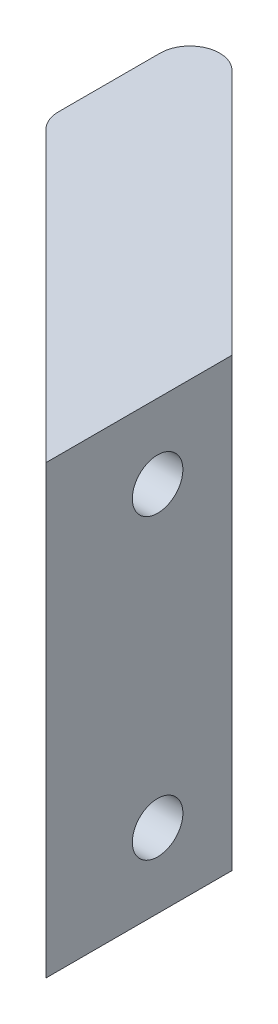
ISO-10303-21;
HEADER;
FILE_DESCRIPTION(('STEP AP214'),'2;1');
FILE_NAME('part.step','',(''),(''),'','','');
FILE_SCHEMA(('AUTOMOTIVE_DESIGN { 1 0 10303 214 1 1 1 1 }'));
ENDSEC;
DATA;
#1=APPLICATION_CONTEXT('core data for automotive mechanical design processes');
#2=APPLICATION_PROTOCOL_DEFINITION('international standard','automotive_design',2000,#1);
#3=PRODUCT_CONTEXT('',#1,'mechanical');
#4=PRODUCT('Part','Part','',(#3));
#5=PRODUCT_RELATED_PRODUCT_CATEGORY('part','',(#4));
#6=PRODUCT_DEFINITION_FORMATION('','',#4);
#7=PRODUCT_DEFINITION_CONTEXT('part definition',#1,'design');
#8=PRODUCT_DEFINITION('design','',#6,#7);
#9=PRODUCT_DEFINITION_SHAPE('','',#8);
#10=(LENGTH_UNIT() NAMED_UNIT(*) SI_UNIT(.MILLI.,.METRE.));
#11=(NAMED_UNIT(*) PLANE_ANGLE_UNIT() SI_UNIT($,.RADIAN.));
#12=(NAMED_UNIT(*) SI_UNIT($,.STERADIAN.) SOLID_ANGLE_UNIT());
#13=UNCERTAINTY_MEASURE_WITH_UNIT(LENGTH_MEASURE(1.E-05),#10,'distance_accuracy_value','');
#14=(GEOMETRIC_REPRESENTATION_CONTEXT(3) GLOBAL_UNCERTAINTY_ASSIGNED_CONTEXT((#13)) GLOBAL_UNIT_ASSIGNED_CONTEXT((#10,
#11,#12)) REPRESENTATION_CONTEXT('',''));
#15=CARTESIAN_POINT('',(0.,0.,0.));
#16=DIRECTION('',(0.,0.,1.));
#17=DIRECTION('',(1.,0.,0.));
#18=AXIS2_PLACEMENT_3D('',#15,#16,#17);
#19=CARTESIAN_POINT('',(-20.,15.,-25.0000000000002));
#20=DIRECTION('',(-0.707106781186551,0.,0.707106781186544));
#21=DIRECTION('',(0.707106781186544,0.,0.707106781186551));
#22=AXIS2_PLACEMENT_3D('',#19,#20,#21);
#23=PLANE('',#22);
#24=DIRECTION('',(-0.707106781186544,0.,-0.707106781186551));
#25=VECTOR('',#24,1.);
#26=CARTESIAN_POINT('',(-20.,-15.,-25.0000000000002));
#27=LINE('',#26,#25);
#28=CARTESIAN_POINT('',(0.,-15.,-5.));
#29=VERTEX_POINT('',#28);
#30=CARTESIAN_POINT('',(-16.5857864376269,-15.,-21.5857864376271));
#31=VERTEX_POINT('',#30);
#32=EDGE_CURVE('E126',#29,#31,#27,.T.);
#33=ORIENTED_EDGE('',*,*,#32,.T.);
#34=DIRECTION('',(0.,-1.,0.));
#35=VECTOR('',#34,1.);
#36=CARTESIAN_POINT('',(-16.5857864376269,15.,-21.5857864376271));
#37=LINE('',#36,#35);
#38=CARTESIAN_POINT('',(-16.5857864376269,15.,-21.5857864376271));
#39=VERTEX_POINT('',#38);
#40=EDGE_CURVE('E11',#31,#39,#37,.F.);
#41=ORIENTED_EDGE('',*,*,#40,.T.);
#42=DIRECTION('',(-0.707106781186544,0.,-0.707106781186551));
#43=VECTOR('',#42,1.);
#44=CARTESIAN_POINT('',(-20.,15.,-25.0000000000002));
#45=LINE('',#44,#43);
#46=CARTESIAN_POINT('',(0.,15.,-5.));
#47=VERTEX_POINT('',#46);
#48=EDGE_CURVE('E90',#47,#39,#45,.T.);
#49=ORIENTED_EDGE('',*,*,#48,.F.);
#50=DIRECTION('',(0.,-1.,0.));
#51=VECTOR('',#50,1.);
#52=CARTESIAN_POINT('',(0.,15.,-5.));
#53=LINE('',#52,#51);
#54=EDGE_CURVE('E93',#47,#29,#53,.T.);
#55=ORIENTED_EDGE('',*,*,#54,.T.);
#56=EDGE_LOOP('',(#33,#41,#49,#55));
#57=FACE_BOUND('',#56,.T.);
#58=ADVANCED_FACE('F38',(#57),#23,.F.);
#59=CARTESIAN_POINT('',(-20.,15.,-12.5000000000002));
#60=DIRECTION('',(1.,0.,0.));
#61=DIRECTION('',(0.,0.,-1.));
#62=AXIS2_PLACEMENT_3D('',#59,#60,#61);
#63=PLANE('',#62);
#64=DIRECTION('',(0.,0.,1.));
#65=VECTOR('',#64,1.);
#66=CARTESIAN_POINT('',(-20.,-15.,-12.5000000000002));
#67=LINE('',#66,#65);
#68=CARTESIAN_POINT('',(-20.,-15.,-20.171572875254));
#69=VERTEX_POINT('',#68);
#70=CARTESIAN_POINT('',(-20.,-15.,-13.3284271247464));
#71=VERTEX_POINT('',#70);
#72=EDGE_CURVE('E147',#69,#71,#67,.T.);
#73=ORIENTED_EDGE('',*,*,#72,.T.);
#74=DIRECTION('',(0.,-1.,0.));
#75=VECTOR('',#74,1.);
#76=CARTESIAN_POINT('',(-20.,15.,-13.3284271247464));
#77=LINE('',#76,#75);
#78=CARTESIAN_POINT('',(-20.,15.,-13.3284271247464));
#79=VERTEX_POINT('',#78);
#80=EDGE_CURVE('E59',#71,#79,#77,.F.);
#81=ORIENTED_EDGE('',*,*,#80,.T.);
#82=DIRECTION('',(0.,0.,1.));
#83=VECTOR('',#82,1.);
#84=CARTESIAN_POINT('',(-20.,15.,-12.5000000000002));
#85=LINE('',#84,#83);
#86=CARTESIAN_POINT('',(-20.,15.,-20.171572875254));
#87=VERTEX_POINT('',#86);
#88=EDGE_CURVE('E96',#87,#79,#85,.T.);
#89=ORIENTED_EDGE('',*,*,#88,.F.);
#90=DIRECTION('',(0.,-1.,0.));
#91=VECTOR('',#90,1.);
#92=CARTESIAN_POINT('',(-20.,15.,-20.171572875254));
#93=LINE('',#92,#91);
#94=EDGE_CURVE('E131',#87,#69,#93,.T.);
#95=ORIENTED_EDGE('',*,*,#94,.T.);
#96=EDGE_LOOP('',(#73,#81,#89,#95));
#97=FACE_BOUND('',#96,.T.);
#98=ADVANCED_FACE('F149',(#97),#63,.F.);
#99=CARTESIAN_POINT('',(0.,15.,7.5));
#100=DIRECTION('',(0.707106781186551,0.,-0.707106781186544));
#101=DIRECTION('',(-0.707106781186544,0.,-0.707106781186551));
#102=AXIS2_PLACEMENT_3D('',#99,#100,#101);
#103=PLANE('',#102);
#104=CARTESIAN_POINT('',(-7.49999999999992,10.,0.));
#105=DIRECTION('',(0.707106781186551,0.,-0.707106781186544));
#106=DIRECTION('',(0.707106781186544,0.,0.707106781186551));
#107=AXIS2_PLACEMENT_3D('',#104,#105,#106);
#108=ELLIPSE('',#107,4.24264068711926,3.);
#109=CARTESIAN_POINT('',(-4.49999999999995,10.,3.));
#110=VERTEX_POINT('',#109);
#111=EDGE_CURVE('E123',#110,#110,#108,.T.);
#112=ORIENTED_EDGE('',*,*,#111,.T.);
#113=EDGE_LOOP('',(#112));
#114=FACE_BOUND('',#113,.T.);
#115=CARTESIAN_POINT('',(-7.49999999999992,-10.,0.));
#116=DIRECTION('',(0.707106781186551,0.,-0.707106781186544));
#117=DIRECTION('',(0.707106781186544,0.,0.707106781186551));
#118=AXIS2_PLACEMENT_3D('',#115,#116,#117);
#119=ELLIPSE('',#118,4.24264068711926,3.);
#120=CARTESIAN_POINT('',(-4.49999999999995,-10.,3.));
#121=VERTEX_POINT('',#120);
#122=EDGE_CURVE('E120',#121,#121,#119,.T.);
#123=ORIENTED_EDGE('',*,*,#122,.T.);
#124=EDGE_LOOP('',(#123));
#125=FACE_BOUND('',#124,.T.);
#126=DIRECTION('',(0.707106781186544,0.,0.707106781186551));
#127=VECTOR('',#126,1.);
#128=CARTESIAN_POINT('',(0.,15.,7.5));
#129=LINE('',#128,#127);
#130=CARTESIAN_POINT('',(-19.4142135623731,15.,-11.9142135623733));
#131=VERTEX_POINT('',#130);
#132=CARTESIAN_POINT('',(0.,15.,7.5));
#133=VERTEX_POINT('',#132);
#134=EDGE_CURVE('E102',#131,#133,#129,.T.);
#135=ORIENTED_EDGE('',*,*,#134,.F.);
#136=DIRECTION('',(0.,-1.,0.));
#137=VECTOR('',#136,1.);
#138=CARTESIAN_POINT('',(-19.4142135623731,15.,-11.9142135623733));
#139=LINE('',#138,#137);
#140=CARTESIAN_POINT('',(-19.4142135623731,-15.,-11.9142135623733));
#141=VERTEX_POINT('',#140);
#142=EDGE_CURVE('E111',#131,#141,#139,.T.);
#143=ORIENTED_EDGE('',*,*,#142,.T.);
#144=DIRECTION('',(0.707106781186544,0.,0.707106781186551));
#145=VECTOR('',#144,1.);
#146=CARTESIAN_POINT('',(0.,-15.,7.5));
#147=LINE('',#146,#145);
#148=CARTESIAN_POINT('',(0.,-15.,7.5));
#149=VERTEX_POINT('',#148);
#150=EDGE_CURVE('E148',#141,#149,#147,.T.);
#151=ORIENTED_EDGE('',*,*,#150,.T.);
#152=DIRECTION('',(0.,-1.,0.));
#153=VECTOR('',#152,1.);
#154=CARTESIAN_POINT('',(0.,15.,7.5));
#155=LINE('',#154,#153);
#156=EDGE_CURVE('E112',#133,#149,#155,.T.);
#157=ORIENTED_EDGE('',*,*,#156,.F.);
#158=EDGE_LOOP('',(#135,#143,#151,#157));
#159=FACE_BOUND('',#158,.T.);
#160=ADVANCED_FACE('F140',(#114,#125,#159),#103,.F.);
#161=CARTESIAN_POINT('',(0.,15.,0.));
#162=DIRECTION('',(-1.,0.,0.));
#163=DIRECTION('',(0.,0.,1.));
#164=AXIS2_PLACEMENT_3D('',#161,#162,#163);
#165=PLANE('',#164);
#166=CARTESIAN_POINT('',(0.,10.,0.));
#167=DIRECTION('',(-1.,0.,0.));
#168=DIRECTION('',(0.,0.,1.));
#169=AXIS2_PLACEMENT_3D('',#166,#167,#168);
#170=CIRCLE('',#169,1.7);
#171=CARTESIAN_POINT('',(0.,10.,1.7));
#172=VERTEX_POINT('',#171);
#173=EDGE_CURVE('E167',#172,#172,#170,.T.);
#174=ORIENTED_EDGE('',*,*,#173,.T.);
#175=EDGE_LOOP('',(#174));
#176=FACE_BOUND('',#175,.T.);
#177=CARTESIAN_POINT('',(0.,-10.,0.));
#178=DIRECTION('',(-1.,0.,0.));
#179=DIRECTION('',(0.,0.,1.));
#180=AXIS2_PLACEMENT_3D('',#177,#178,#179);
#181=CIRCLE('',#180,1.7);
#182=CARTESIAN_POINT('',(0.,-10.,1.7));
#183=VERTEX_POINT('',#182);
#184=EDGE_CURVE('E159',#183,#183,#181,.T.);
#185=ORIENTED_EDGE('',*,*,#184,.T.);
#186=EDGE_LOOP('',(#185));
#187=FACE_BOUND('',#186,.T.);
#188=DIRECTION('',(0.,0.,-1.));
#189=VECTOR('',#188,1.);
#190=CARTESIAN_POINT('',(0.,-15.,0.));
#191=LINE('',#190,#189);
#192=EDGE_CURVE('E106',#149,#29,#191,.T.);
#193=ORIENTED_EDGE('',*,*,#192,.T.);
#194=ORIENTED_EDGE('',*,*,#54,.F.);
#195=DIRECTION('',(0.,0.,-1.));
#196=VECTOR('',#195,1.);
#197=CARTESIAN_POINT('',(0.,15.,-5.));
#198=LINE('',#197,#196);
#199=EDGE_CURVE('E97',#133,#47,#198,.T.);
#200=ORIENTED_EDGE('',*,*,#199,.F.);
#201=ORIENTED_EDGE('',*,*,#156,.T.);
#202=EDGE_LOOP('',(#193,#194,#200,#201));
#203=FACE_BOUND('',#202,.T.);
#204=ADVANCED_FACE('F108',(#176,#187,#203),#165,.F.);
#205=CARTESIAN_POINT('',(0.,15.,0.));
#206=DIRECTION('',(0.,-1.,0.));
#207=DIRECTION('',(0.,0.,-1.));
#208=AXIS2_PLACEMENT_3D('',#205,#206,#207);
#209=PLANE('',#208);
#210=ORIENTED_EDGE('',*,*,#88,.T.);
#211=CARTESIAN_POINT('',(-18.,15.,-13.3284271247464));
#212=DIRECTION('',(0.,-1.,0.));
#213=DIRECTION('',(0.,0.,-1.));
#214=AXIS2_PLACEMENT_3D('',#211,#212,#213);
#215=CIRCLE('',#214,2.);
#216=EDGE_CURVE('E46',#79,#131,#215,.F.);
#217=ORIENTED_EDGE('',*,*,#216,.T.);
#218=ORIENTED_EDGE('',*,*,#134,.T.);
#219=ORIENTED_EDGE('',*,*,#199,.T.);
#220=ORIENTED_EDGE('',*,*,#48,.T.);
#221=CARTESIAN_POINT('',(-18.,15.,-20.171572875254));
#222=DIRECTION('',(0.,-1.,0.));
#223=DIRECTION('',(0.,0.,-1.));
#224=AXIS2_PLACEMENT_3D('',#221,#222,#223);
#225=CIRCLE('',#224,2.);
#226=EDGE_CURVE('E135',#39,#87,#225,.F.);
#227=ORIENTED_EDGE('',*,*,#226,.T.);
#228=EDGE_LOOP('',(#210,#217,#218,#219,#220,#227));
#229=FACE_BOUND('',#228,.T.);
#230=ADVANCED_FACE('F100',(#229),#209,.F.);
#231=CARTESIAN_POINT('',(0.,-15.,0.));
#232=DIRECTION('',(0.,-1.,0.));
#233=DIRECTION('',(0.,0.,-1.));
#234=AXIS2_PLACEMENT_3D('',#231,#232,#233);
#235=PLANE('',#234);
#236=ORIENTED_EDGE('',*,*,#150,.F.);
#237=CARTESIAN_POINT('',(-18.,-15.,-13.3284271247464));
#238=DIRECTION('',(0.,-1.,0.));
#239=DIRECTION('',(0.,0.,-1.));
#240=AXIS2_PLACEMENT_3D('',#237,#238,#239);
#241=CIRCLE('',#240,2.);
#242=EDGE_CURVE('E129',#141,#71,#241,.T.);
#243=ORIENTED_EDGE('',*,*,#242,.T.);
#244=ORIENTED_EDGE('',*,*,#72,.F.);
#245=CARTESIAN_POINT('',(-18.,-15.,-20.171572875254));
#246=DIRECTION('',(0.,-1.,0.));
#247=DIRECTION('',(0.,0.,-1.));
#248=AXIS2_PLACEMENT_3D('',#245,#246,#247);
#249=CIRCLE('',#248,2.);
#250=EDGE_CURVE('E115',#69,#31,#249,.T.);
#251=ORIENTED_EDGE('',*,*,#250,.T.);
#252=ORIENTED_EDGE('',*,*,#32,.F.);
#253=ORIENTED_EDGE('',*,*,#192,.F.);
#254=EDGE_LOOP('',(#236,#243,#244,#251,#252,#253));
#255=FACE_BOUND('',#254,.T.);
#256=ADVANCED_FACE('F146',(#255),#235,.T.);
#257=CARTESIAN_POINT('',(-20.,-10.,0.));
#258=DIRECTION('',(1.,0.,0.));
#259=DIRECTION('',(0.,0.,-1.));
#260=AXIS2_PLACEMENT_3D('',#257,#258,#259);
#261=CYLINDRICAL_SURFACE('',#260,3.);
#262=CARTESIAN_POINT('',(-4.,-10.,0.));
#263=DIRECTION('',(1.,0.,0.));
#264=DIRECTION('',(0.,0.,-1.));
#265=AXIS2_PLACEMENT_3D('',#262,#263,#264);
#266=CIRCLE('',#265,3.);
#267=CARTESIAN_POINT('',(-4.,-10.,-3.));
#268=VERTEX_POINT('',#267);
#269=EDGE_CURVE('E156',#268,#268,#266,.T.);
#270=ORIENTED_EDGE('',*,*,#269,.T.);
#271=EDGE_LOOP('',(#270));
#272=FACE_BOUND('',#271,.T.);
#273=ORIENTED_EDGE('',*,*,#122,.F.);
#274=EDGE_LOOP('',(#273));
#275=FACE_BOUND('',#274,.T.);
#276=ADVANCED_FACE('F195',(#272,#275),#261,.F.);
#277=CARTESIAN_POINT('',(-4.,-10.,0.));
#278=DIRECTION('',(1.,0.,0.));
#279=DIRECTION('',(0.,0.,-1.));
#280=AXIS2_PLACEMENT_3D('',#277,#278,#279);
#281=PLANE('',#280);
#282=CARTESIAN_POINT('',(-4.,-10.,0.));
#283=DIRECTION('',(-1.,0.,0.));
#284=DIRECTION('',(0.,0.,1.));
#285=AXIS2_PLACEMENT_3D('',#282,#283,#284);
#286=CIRCLE('',#285,1.7);
#287=CARTESIAN_POINT('',(-4.,-10.,1.7));
#288=VERTEX_POINT('',#287);
#289=EDGE_CURVE('E164',#288,#288,#286,.T.);
#290=ORIENTED_EDGE('',*,*,#289,.F.);
#291=EDGE_LOOP('',(#290));
#292=FACE_BOUND('',#291,.T.);
#293=ORIENTED_EDGE('',*,*,#269,.F.);
#294=EDGE_LOOP('',(#293));
#295=FACE_BOUND('',#294,.T.);
#296=ADVANCED_FACE('F186',(#292,#295),#281,.F.);
#297=CARTESIAN_POINT('',(-20.,10.,0.));
#298=DIRECTION('',(1.,0.,0.));
#299=DIRECTION('',(0.,0.,-1.));
#300=AXIS2_PLACEMENT_3D('',#297,#298,#299);
#301=CYLINDRICAL_SURFACE('',#300,3.);
#302=CARTESIAN_POINT('',(-4.,10.,0.));
#303=DIRECTION('',(1.,0.,0.));
#304=DIRECTION('',(0.,0.,-1.));
#305=AXIS2_PLACEMENT_3D('',#302,#303,#304);
#306=CIRCLE('',#305,3.);
#307=CARTESIAN_POINT('',(-4.,10.,-3.));
#308=VERTEX_POINT('',#307);
#309=EDGE_CURVE('E124',#308,#308,#306,.T.);
#310=ORIENTED_EDGE('',*,*,#309,.T.);
#311=EDGE_LOOP('',(#310));
#312=FACE_BOUND('',#311,.T.);
#313=ORIENTED_EDGE('',*,*,#111,.F.);
#314=EDGE_LOOP('',(#313));
#315=FACE_BOUND('',#314,.T.);
#316=ADVANCED_FACE('F180',(#312,#315),#301,.F.);
#317=CARTESIAN_POINT('',(-4.,10.,0.));
#318=DIRECTION('',(1.,0.,0.));
#319=DIRECTION('',(0.,0.,-1.));
#320=AXIS2_PLACEMENT_3D('',#317,#318,#319);
#321=PLANE('',#320);
#322=CARTESIAN_POINT('',(-4.,10.,0.));
#323=DIRECTION('',(-1.,0.,0.));
#324=DIRECTION('',(0.,0.,1.));
#325=AXIS2_PLACEMENT_3D('',#322,#323,#324);
#326=CIRCLE('',#325,1.7);
#327=CARTESIAN_POINT('',(-4.,10.,1.7));
#328=VERTEX_POINT('',#327);
#329=EDGE_CURVE('E170',#328,#328,#326,.T.);
#330=ORIENTED_EDGE('',*,*,#329,.F.);
#331=EDGE_LOOP('',(#330));
#332=FACE_BOUND('',#331,.T.);
#333=ORIENTED_EDGE('',*,*,#309,.F.);
#334=EDGE_LOOP('',(#333));
#335=FACE_BOUND('',#334,.T.);
#336=ADVANCED_FACE('F176',(#332,#335),#321,.F.);
#337=CARTESIAN_POINT('',(-4.,-10.,0.));
#338=DIRECTION('',(-1.,0.,0.));
#339=DIRECTION('',(0.,0.,1.));
#340=AXIS2_PLACEMENT_3D('',#337,#338,#339);
#341=CYLINDRICAL_SURFACE('',#340,1.7);
#342=ORIENTED_EDGE('',*,*,#184,.F.);
#343=EDGE_LOOP('',(#342));
#344=FACE_BOUND('',#343,.T.);
#345=ORIENTED_EDGE('',*,*,#289,.T.);
#346=EDGE_LOOP('',(#345));
#347=FACE_BOUND('',#346,.T.);
#348=ADVANCED_FACE('F179',(#344,#347),#341,.F.);
#349=CARTESIAN_POINT('',(-4.,10.,0.));
#350=DIRECTION('',(-1.,0.,0.));
#351=DIRECTION('',(0.,0.,1.));
#352=AXIS2_PLACEMENT_3D('',#349,#350,#351);
#353=CYLINDRICAL_SURFACE('',#352,1.7);
#354=ORIENTED_EDGE('',*,*,#173,.F.);
#355=EDGE_LOOP('',(#354));
#356=FACE_BOUND('',#355,.T.);
#357=ORIENTED_EDGE('',*,*,#329,.T.);
#358=EDGE_LOOP('',(#357));
#359=FACE_BOUND('',#358,.T.);
#360=ADVANCED_FACE('F174',(#356,#359),#353,.F.);
#361=CARTESIAN_POINT('',(-18.,15.,-13.3284271247464));
#362=DIRECTION('',(0.,-1.,0.));
#363=DIRECTION('',(0.,0.,-1.));
#364=AXIS2_PLACEMENT_3D('',#361,#362,#363);
#365=CYLINDRICAL_SURFACE('',#364,2.);
#366=ORIENTED_EDGE('',*,*,#216,.F.);
#367=ORIENTED_EDGE('',*,*,#80,.F.);
#368=ORIENTED_EDGE('',*,*,#242,.F.);
#369=ORIENTED_EDGE('',*,*,#142,.F.);
#370=EDGE_LOOP('',(#366,#367,#368,#369));
#371=FACE_BOUND('',#370,.T.);
#372=ADVANCED_FACE('F143',(#371),#365,.T.);
#373=CARTESIAN_POINT('',(-18.,15.,-20.171572875254));
#374=DIRECTION('',(0.,-1.,0.));
#375=DIRECTION('',(0.,0.,-1.));
#376=AXIS2_PLACEMENT_3D('',#373,#374,#375);
#377=CYLINDRICAL_SURFACE('',#376,2.);
#378=ORIENTED_EDGE('',*,*,#226,.F.);
#379=ORIENTED_EDGE('',*,*,#40,.F.);
#380=ORIENTED_EDGE('',*,*,#250,.F.);
#381=ORIENTED_EDGE('',*,*,#94,.F.);
#382=EDGE_LOOP('',(#378,#379,#380,#381));
#383=FACE_BOUND('',#382,.T.);
#384=ADVANCED_FACE('F40',(#383),#377,.T.);
#385=CLOSED_SHELL('',(#58,#98,#160,#204,#230,#256,#276,#296,#316,#336,#348,#360,#372,#384));
#386=MANIFOLD_SOLID_BREP('B2',#385);
#387=ADVANCED_BREP_SHAPE_REPRESENTATION('',(#18,#386),#14);
#388=SHAPE_DEFINITION_REPRESENTATION(#9,#387);
ENDSEC;
END-ISO-10303-21;
